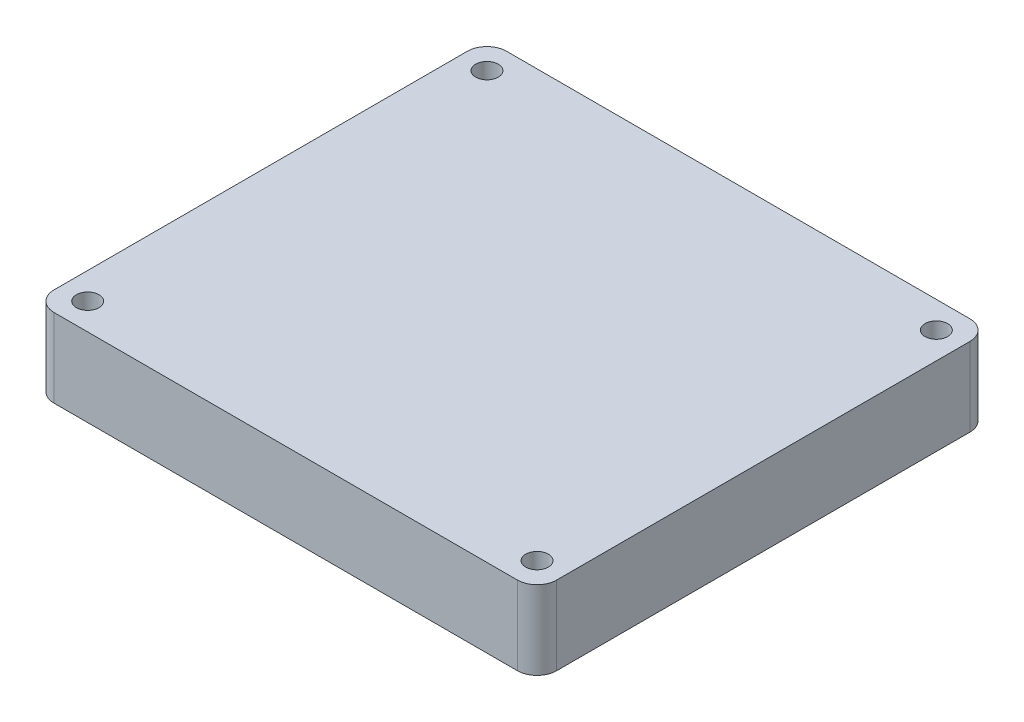
ISO-10303-21;
HEADER;
FILE_DESCRIPTION(('STEP AP214'),'2;1');
FILE_NAME('part.step','',(''),(''),'','','');
FILE_SCHEMA(('AUTOMOTIVE_DESIGN { 1 0 10303 214 1 1 1 1 }'));
ENDSEC;
DATA;
#1=APPLICATION_CONTEXT('core data for automotive mechanical design processes');
#2=APPLICATION_PROTOCOL_DEFINITION('international standard','automotive_design',2000,#1);
#3=PRODUCT_CONTEXT('',#1,'mechanical');
#4=PRODUCT('Part','Part','',(#3));
#5=PRODUCT_RELATED_PRODUCT_CATEGORY('part','',(#4));
#6=PRODUCT_DEFINITION_FORMATION('','',#4);
#7=PRODUCT_DEFINITION_CONTEXT('part definition',#1,'design');
#8=PRODUCT_DEFINITION('design','',#6,#7);
#9=PRODUCT_DEFINITION_SHAPE('','',#8);
#10=(LENGTH_UNIT() NAMED_UNIT(*) SI_UNIT(.MILLI.,.METRE.));
#11=(NAMED_UNIT(*) PLANE_ANGLE_UNIT() SI_UNIT($,.RADIAN.));
#12=(NAMED_UNIT(*) SI_UNIT($,.STERADIAN.) SOLID_ANGLE_UNIT());
#13=UNCERTAINTY_MEASURE_WITH_UNIT(LENGTH_MEASURE(1.E-05),#10,'distance_accuracy_value','');
#14=(GEOMETRIC_REPRESENTATION_CONTEXT(3) GLOBAL_UNCERTAINTY_ASSIGNED_CONTEXT((#13)) GLOBAL_UNIT_ASSIGNED_CONTEXT((#10,
#11,#12)) REPRESENTATION_CONTEXT('',''));
#15=CARTESIAN_POINT('',(0.,0.,0.));
#16=DIRECTION('',(0.,0.,1.));
#17=DIRECTION('',(1.,0.,0.));
#18=AXIS2_PLACEMENT_3D('',#15,#16,#17);
#19=CARTESIAN_POINT('',(-66.0264767181984,10.16,6.88511388237897));
#20=DIRECTION('',(1.,0.,0.));
#21=DIRECTION('',(0.,0.,-1.));
#22=AXIS2_PLACEMENT_3D('',#19,#20,#21);
#23=PLANE('',#22);
#24=DIRECTION('',(0.,0.,1.));
#25=VECTOR('',#24,1.);
#26=CARTESIAN_POINT('',(-66.0264767181984,0.,6.88511388237897));
#27=LINE('',#26,#25);
#28=CARTESIAN_POINT('',(-66.0264767181984,0.,-49.096486117621));
#29=VERTEX_POINT('',#28);
#30=CARTESIAN_POINT('',(-66.0264767181984,0.,4.34511388237897));
#31=VERTEX_POINT('',#30);
#32=EDGE_CURVE('E128',#29,#31,#27,.T.);
#33=ORIENTED_EDGE('',*,*,#32,.T.);
#34=DIRECTION('',(0.,-1.,0.));
#35=VECTOR('',#34,1.);
#36=CARTESIAN_POINT('',(-66.0264767181984,10.16,4.34511388237897));
#37=LINE('',#36,#35);
#38=CARTESIAN_POINT('',(-66.0264767181984,10.16,4.34511388237897));
#39=VERTEX_POINT('',#38);
#40=EDGE_CURVE('E11',#31,#39,#37,.F.);
#41=ORIENTED_EDGE('',*,*,#40,.T.);
#42=DIRECTION('',(0.,0.,1.));
#43=VECTOR('',#42,1.);
#44=CARTESIAN_POINT('',(-66.0264767181984,10.16,6.88511388237897));
#45=LINE('',#44,#43);
#46=CARTESIAN_POINT('',(-66.0264767181984,10.16,-49.096486117621));
#47=VERTEX_POINT('',#46);
#48=EDGE_CURVE('E126',#47,#39,#45,.T.);
#49=ORIENTED_EDGE('',*,*,#48,.F.);
#50=DIRECTION('',(0.,-1.,0.));
#51=VECTOR('',#50,1.);
#52=CARTESIAN_POINT('',(-66.0264767181984,10.16,-49.096486117621));
#53=LINE('',#52,#51);
#54=EDGE_CURVE('E40',#47,#29,#53,.T.);
#55=ORIENTED_EDGE('',*,*,#54,.T.);
#56=EDGE_LOOP('',(#33,#41,#49,#55));
#57=FACE_BOUND('',#56,.T.);
#58=ADVANCED_FACE('F32',(#57),#23,.F.);
#59=CARTESIAN_POINT('',(-66.0264767181984,10.16,6.88511388237897));
#60=DIRECTION('',(0.,0.,-1.));
#61=DIRECTION('',(-1.,0.,0.));
#62=AXIS2_PLACEMENT_3D('',#59,#60,#61);
#63=PLANE('',#62);
#64=DIRECTION('',(1.,0.,0.));
#65=VECTOR('',#64,1.);
#66=CARTESIAN_POINT('',(-66.0264767181984,0.,6.88511388237897));
#67=LINE('',#66,#65);
#68=CARTESIAN_POINT('',(-63.4864767181984,0.,6.88511388237897));
#69=VERTEX_POINT('',#68);
#70=CARTESIAN_POINT('',(-3.56787671819842,0.,6.88511388237897));
#71=VERTEX_POINT('',#70);
#72=EDGE_CURVE('E124',#69,#71,#67,.T.);
#73=ORIENTED_EDGE('',*,*,#72,.T.);
#74=DIRECTION('',(0.,-1.,0.));
#75=VECTOR('',#74,1.);
#76=CARTESIAN_POINT('',(-3.56787671819842,10.16,6.88511388237897));
#77=LINE('',#76,#75);
#78=CARTESIAN_POINT('',(-3.56787671819842,10.16,6.88511388237897));
#79=VERTEX_POINT('',#78);
#80=EDGE_CURVE('E103',#71,#79,#77,.F.);
#81=ORIENTED_EDGE('',*,*,#80,.T.);
#82=DIRECTION('',(1.,0.,0.));
#83=VECTOR('',#82,1.);
#84=CARTESIAN_POINT('',(-66.0264767181984,10.16,6.88511388237897));
#85=LINE('',#84,#83);
#86=CARTESIAN_POINT('',(-63.4864767181984,10.16,6.88511388237897));
#87=VERTEX_POINT('',#86);
#88=EDGE_CURVE('E168',#87,#79,#85,.T.);
#89=ORIENTED_EDGE('',*,*,#88,.F.);
#90=DIRECTION('',(0.,-1.,0.));
#91=VECTOR('',#90,1.);
#92=CARTESIAN_POINT('',(-63.4864767181984,10.16,6.88511388237897));
#93=LINE('',#92,#91);
#94=EDGE_CURVE('E108',#87,#69,#93,.T.);
#95=ORIENTED_EDGE('',*,*,#94,.T.);
#96=EDGE_LOOP('',(#73,#81,#89,#95));
#97=FACE_BOUND('',#96,.T.);
#98=ADVANCED_FACE('F216',(#97),#63,.F.);
#99=CARTESIAN_POINT('',(-1.02787671819841,10.16,6.88511388237897));
#100=DIRECTION('',(-1.,0.,0.));
#101=DIRECTION('',(0.,0.,1.));
#102=AXIS2_PLACEMENT_3D('',#99,#100,#101);
#103=PLANE('',#102);
#104=DIRECTION('',(0.,0.,-1.));
#105=VECTOR('',#104,1.);
#106=CARTESIAN_POINT('',(-1.02787671819841,10.16,6.88511388237897));
#107=LINE('',#106,#105);
#108=CARTESIAN_POINT('',(-1.02787671819841,10.16,4.34511388237897));
#109=VERTEX_POINT('',#108);
#110=CARTESIAN_POINT('',(-1.02787671819841,10.16,-49.096486117621));
#111=VERTEX_POINT('',#110);
#112=EDGE_CURVE('E117',#109,#111,#107,.T.);
#113=ORIENTED_EDGE('',*,*,#112,.F.);
#114=DIRECTION('',(0.,-1.,0.));
#115=VECTOR('',#114,1.);
#116=CARTESIAN_POINT('',(-1.02787671819841,10.16,4.34511388237897));
#117=LINE('',#116,#115);
#118=CARTESIAN_POINT('',(-1.02787671819841,0.,4.34511388237897));
#119=VERTEX_POINT('',#118);
#120=EDGE_CURVE('E102',#109,#119,#117,.T.);
#121=ORIENTED_EDGE('',*,*,#120,.T.);
#122=DIRECTION('',(0.,0.,-1.));
#123=VECTOR('',#122,1.);
#124=CARTESIAN_POINT('',(-1.02787671819841,0.,6.88511388237897));
#125=LINE('',#124,#123);
#126=CARTESIAN_POINT('',(-1.02787671819841,0.,-49.096486117621));
#127=VERTEX_POINT('',#126);
#128=EDGE_CURVE('E115',#119,#127,#125,.T.);
#129=ORIENTED_EDGE('',*,*,#128,.T.);
#130=DIRECTION('',(0.,-1.,0.));
#131=VECTOR('',#130,1.);
#132=CARTESIAN_POINT('',(-1.02787671819841,10.16,-49.096486117621));
#133=LINE('',#132,#131);
#134=EDGE_CURVE('E119',#127,#111,#133,.F.);
#135=ORIENTED_EDGE('',*,*,#134,.T.);
#136=EDGE_LOOP('',(#113,#121,#129,#135));
#137=FACE_BOUND('',#136,.T.);
#138=ADVANCED_FACE('F114',(#137),#103,.F.);
#139=CARTESIAN_POINT('',(-66.0264767181984,10.16,-51.636486117621));
#140=DIRECTION('',(0.,0.,1.));
#141=DIRECTION('',(1.,0.,0.));
#142=AXIS2_PLACEMENT_3D('',#139,#140,#141);
#143=PLANE('',#142);
#144=DIRECTION('',(-1.,0.,0.));
#145=VECTOR('',#144,1.);
#146=CARTESIAN_POINT('',(-66.0264767181984,10.16,-51.636486117621));
#147=LINE('',#146,#145);
#148=CARTESIAN_POINT('',(-3.56787671819842,10.16,-51.636486117621));
#149=VERTEX_POINT('',#148);
#150=CARTESIAN_POINT('',(-63.4864767181984,10.16,-51.636486117621));
#151=VERTEX_POINT('',#150);
#152=EDGE_CURVE('E132',#149,#151,#147,.T.);
#153=ORIENTED_EDGE('',*,*,#152,.F.);
#154=DIRECTION('',(0.,-1.,0.));
#155=VECTOR('',#154,1.);
#156=CARTESIAN_POINT('',(-3.56787671819842,10.16,-51.636486117621));
#157=LINE('',#156,#155);
#158=CARTESIAN_POINT('',(-3.56787671819842,0.,-51.636486117621));
#159=VERTEX_POINT('',#158);
#160=EDGE_CURVE('E149',#149,#159,#157,.T.);
#161=ORIENTED_EDGE('',*,*,#160,.T.);
#162=DIRECTION('',(-1.,0.,0.));
#163=VECTOR('',#162,1.);
#164=CARTESIAN_POINT('',(-66.0264767181984,0.,-51.636486117621));
#165=LINE('',#164,#163);
#166=CARTESIAN_POINT('',(-63.4864767181984,0.,-51.636486117621));
#167=VERTEX_POINT('',#166);
#168=EDGE_CURVE('E123',#159,#167,#165,.T.);
#169=ORIENTED_EDGE('',*,*,#168,.T.);
#170=DIRECTION('',(0.,-1.,0.));
#171=VECTOR('',#170,1.);
#172=CARTESIAN_POINT('',(-63.4864767181984,10.16,-51.636486117621));
#173=LINE('',#172,#171);
#174=EDGE_CURVE('E47',#167,#151,#173,.F.);
#175=ORIENTED_EDGE('',*,*,#174,.T.);
#176=EDGE_LOOP('',(#153,#161,#169,#175));
#177=FACE_BOUND('',#176,.T.);
#178=ADVANCED_FACE('F205',(#177),#143,.F.);
#179=CARTESIAN_POINT('',(0.,10.16,0.));
#180=DIRECTION('',(0.,-1.,0.));
#181=DIRECTION('',(0.,0.,-1.));
#182=AXIS2_PLACEMENT_3D('',#179,#180,#181);
#183=PLANE('',#182);
#184=CARTESIAN_POINT('',(-62.5847767181984,10.16,3.44341388237897));
#185=DIRECTION('',(0.,1.,0.));
#186=DIRECTION('',(0.,0.,-1.));
#187=AXIS2_PLACEMENT_3D('',#184,#185,#186);
#188=CIRCLE('',#187,1.4605);
#189=CARTESIAN_POINT('',(-62.5847767181984,10.16,1.98291388237897));
#190=VERTEX_POINT('',#189);
#191=EDGE_CURVE('E187',#190,#190,#188,.T.);
#192=ORIENTED_EDGE('',*,*,#191,.F.);
#193=EDGE_LOOP('',(#192));
#194=FACE_BOUND('',#193,.T.);
#195=CARTESIAN_POINT('',(-62.5847767181984,10.16,-48.194786117621));
#196=DIRECTION('',(0.,1.,0.));
#197=DIRECTION('',(0.,0.,1.));
#198=AXIS2_PLACEMENT_3D('',#195,#196,#197);
#199=CIRCLE('',#198,1.4605);
#200=CARTESIAN_POINT('',(-62.5847767181984,10.16,-46.734286117621));
#201=VERTEX_POINT('',#200);
#202=EDGE_CURVE('E181',#201,#201,#199,.T.);
#203=ORIENTED_EDGE('',*,*,#202,.F.);
#204=EDGE_LOOP('',(#203));
#205=FACE_BOUND('',#204,.T.);
#206=CARTESIAN_POINT('',(-4.46957671819842,10.16,-48.194786117621));
#207=DIRECTION('',(0.,1.,0.));
#208=DIRECTION('',(0.,0.,-1.));
#209=AXIS2_PLACEMENT_3D('',#206,#207,#208);
#210=CIRCLE('',#209,1.4605);
#211=CARTESIAN_POINT('',(-4.46957671819842,10.16,-49.655286117621));
#212=VERTEX_POINT('',#211);
#213=EDGE_CURVE('E175',#212,#212,#210,.T.);
#214=ORIENTED_EDGE('',*,*,#213,.F.);
#215=EDGE_LOOP('',(#214));
#216=FACE_BOUND('',#215,.T.);
#217=CARTESIAN_POINT('',(-4.46957671819842,10.16,3.44341388237897));
#218=DIRECTION('',(0.,1.,0.));
#219=DIRECTION('',(0.,0.,1.));
#220=AXIS2_PLACEMENT_3D('',#217,#218,#219);
#221=CIRCLE('',#220,1.4605);
#222=CARTESIAN_POINT('',(-4.46957671819842,10.16,4.90391388237897));
#223=VERTEX_POINT('',#222);
#224=EDGE_CURVE('E163',#223,#223,#221,.T.);
#225=ORIENTED_EDGE('',*,*,#224,.F.);
#226=EDGE_LOOP('',(#225));
#227=FACE_BOUND('',#226,.T.);
#228=ORIENTED_EDGE('',*,*,#88,.T.);
#229=CARTESIAN_POINT('',(-3.56787671819841,10.16,4.34511388237897));
#230=DIRECTION('',(0.,-1.,0.));
#231=DIRECTION('',(0.,0.,-1.));
#232=AXIS2_PLACEMENT_3D('',#229,#230,#231);
#233=CIRCLE('',#232,2.54);
#234=EDGE_CURVE('E146',#79,#109,#233,.F.);
#235=ORIENTED_EDGE('',*,*,#234,.T.);
#236=ORIENTED_EDGE('',*,*,#112,.T.);
#237=CARTESIAN_POINT('',(-3.56787671819842,10.16,-49.096486117621));
#238=DIRECTION('',(0.,-1.,0.));
#239=DIRECTION('',(0.,0.,-1.));
#240=AXIS2_PLACEMENT_3D('',#237,#238,#239);
#241=CIRCLE('',#240,2.54);
#242=EDGE_CURVE('E54',#111,#149,#241,.F.);
#243=ORIENTED_EDGE('',*,*,#242,.T.);
#244=ORIENTED_EDGE('',*,*,#152,.T.);
#245=CARTESIAN_POINT('',(-63.4864767181984,10.16,-49.096486117621));
#246=DIRECTION('',(0.,-1.,0.));
#247=DIRECTION('',(0.,0.,-1.));
#248=AXIS2_PLACEMENT_3D('',#245,#246,#247);
#249=CIRCLE('',#248,2.54);
#250=EDGE_CURVE('E141',#151,#47,#249,.F.);
#251=ORIENTED_EDGE('',*,*,#250,.T.);
#252=ORIENTED_EDGE('',*,*,#48,.T.);
#253=CARTESIAN_POINT('',(-63.4864767181984,10.16,4.34511388237897));
#254=DIRECTION('',(0.,-1.,0.));
#255=DIRECTION('',(0.,0.,-1.));
#256=AXIS2_PLACEMENT_3D('',#253,#254,#255);
#257=CIRCLE('',#256,2.54);
#258=EDGE_CURVE('E143',#39,#87,#257,.F.);
#259=ORIENTED_EDGE('',*,*,#258,.T.);
#260=EDGE_LOOP('',(#228,#235,#236,#243,#244,#251,#252,#259));
#261=FACE_BOUND('',#260,.T.);
#262=ADVANCED_FACE('F202',(#194,#205,#216,#227,#261),#183,.F.);
#263=CARTESIAN_POINT('',(0.,0.,0.));
#264=DIRECTION('',(0.,-1.,0.));
#265=DIRECTION('',(0.,0.,-1.));
#266=AXIS2_PLACEMENT_3D('',#263,#264,#265);
#267=PLANE('',#266);
#268=CARTESIAN_POINT('',(-62.5847767181984,0.,3.44341388237897));
#269=DIRECTION('',(0.,1.,0.));
#270=DIRECTION('',(0.,0.,-1.));
#271=AXIS2_PLACEMENT_3D('',#268,#269,#270);
#272=CIRCLE('',#271,1.4605);
#273=CARTESIAN_POINT('',(-62.5847767181984,0.,1.98291388237897));
#274=VERTEX_POINT('',#273);
#275=EDGE_CURVE('E184',#274,#274,#272,.T.);
#276=ORIENTED_EDGE('',*,*,#275,.T.);
#277=EDGE_LOOP('',(#276));
#278=FACE_BOUND('',#277,.T.);
#279=CARTESIAN_POINT('',(-62.5847767181984,0.,-48.194786117621));
#280=DIRECTION('',(0.,1.,0.));
#281=DIRECTION('',(0.,0.,1.));
#282=AXIS2_PLACEMENT_3D('',#279,#280,#281);
#283=CIRCLE('',#282,1.4605);
#284=CARTESIAN_POINT('',(-62.5847767181984,0.,-46.734286117621));
#285=VERTEX_POINT('',#284);
#286=EDGE_CURVE('E178',#285,#285,#283,.T.);
#287=ORIENTED_EDGE('',*,*,#286,.T.);
#288=EDGE_LOOP('',(#287));
#289=FACE_BOUND('',#288,.T.);
#290=CARTESIAN_POINT('',(-4.46957671819842,0.,-48.194786117621));
#291=DIRECTION('',(0.,1.,0.));
#292=DIRECTION('',(0.,0.,-1.));
#293=AXIS2_PLACEMENT_3D('',#290,#291,#292);
#294=CIRCLE('',#293,1.4605);
#295=CARTESIAN_POINT('',(-4.46957671819842,0.,-49.655286117621));
#296=VERTEX_POINT('',#295);
#297=EDGE_CURVE('E173',#296,#296,#294,.T.);
#298=ORIENTED_EDGE('',*,*,#297,.T.);
#299=EDGE_LOOP('',(#298));
#300=FACE_BOUND('',#299,.T.);
#301=CARTESIAN_POINT('',(-4.46957671819842,0.,3.44341388237897));
#302=DIRECTION('',(0.,1.,0.));
#303=DIRECTION('',(0.,0.,1.));
#304=AXIS2_PLACEMENT_3D('',#301,#302,#303);
#305=CIRCLE('',#304,1.4605);
#306=CARTESIAN_POINT('',(-4.46957671819842,0.,4.90391388237897));
#307=VERTEX_POINT('',#306);
#308=EDGE_CURVE('E161',#307,#307,#305,.T.);
#309=ORIENTED_EDGE('',*,*,#308,.T.);
#310=EDGE_LOOP('',(#309));
#311=FACE_BOUND('',#310,.T.);
#312=ORIENTED_EDGE('',*,*,#128,.F.);
#313=CARTESIAN_POINT('',(-3.56787671819841,0.,4.34511388237897));
#314=DIRECTION('',(0.,-1.,0.));
#315=DIRECTION('',(0.,0.,-1.));
#316=AXIS2_PLACEMENT_3D('',#313,#314,#315);
#317=CIRCLE('',#316,2.54);
#318=EDGE_CURVE('E98',#119,#71,#317,.T.);
#319=ORIENTED_EDGE('',*,*,#318,.T.);
#320=ORIENTED_EDGE('',*,*,#72,.F.);
#321=CARTESIAN_POINT('',(-63.4864767181984,0.,4.34511388237897));
#322=DIRECTION('',(0.,-1.,0.));
#323=DIRECTION('',(0.,0.,-1.));
#324=AXIS2_PLACEMENT_3D('',#321,#322,#323);
#325=CIRCLE('',#324,2.54);
#326=EDGE_CURVE('E135',#69,#31,#325,.T.);
#327=ORIENTED_EDGE('',*,*,#326,.T.);
#328=ORIENTED_EDGE('',*,*,#32,.F.);
#329=CARTESIAN_POINT('',(-63.4864767181984,0.,-49.096486117621));
#330=DIRECTION('',(0.,-1.,0.));
#331=DIRECTION('',(0.,0.,-1.));
#332=AXIS2_PLACEMENT_3D('',#329,#330,#331);
#333=CIRCLE('',#332,2.54);
#334=EDGE_CURVE('E118',#29,#167,#333,.T.);
#335=ORIENTED_EDGE('',*,*,#334,.T.);
#336=ORIENTED_EDGE('',*,*,#168,.F.);
#337=CARTESIAN_POINT('',(-3.56787671819842,0.,-49.096486117621));
#338=DIRECTION('',(0.,-1.,0.));
#339=DIRECTION('',(0.,0.,-1.));
#340=AXIS2_PLACEMENT_3D('',#337,#338,#339);
#341=CIRCLE('',#340,2.54);
#342=EDGE_CURVE('E109',#159,#127,#341,.T.);
#343=ORIENTED_EDGE('',*,*,#342,.T.);
#344=EDGE_LOOP('',(#312,#319,#320,#327,#328,#335,#336,#343));
#345=FACE_BOUND('',#344,.T.);
#346=ADVANCED_FACE('F121',(#278,#289,#300,#311,#345),#267,.T.);
#347=CARTESIAN_POINT('',(-4.46957671819842,0.,3.44341388237897));
#348=DIRECTION('',(0.,1.,0.));
#349=DIRECTION('',(0.,0.,1.));
#350=AXIS2_PLACEMENT_3D('',#347,#348,#349);
#351=CYLINDRICAL_SURFACE('',#350,1.4605);
#352=ORIENTED_EDGE('',*,*,#308,.F.);
#353=EDGE_LOOP('',(#352));
#354=FACE_BOUND('',#353,.T.);
#355=ORIENTED_EDGE('',*,*,#224,.T.);
#356=EDGE_LOOP('',(#355));
#357=FACE_BOUND('',#356,.T.);
#358=ADVANCED_FACE('F246',(#354,#357),#351,.F.);
#359=CARTESIAN_POINT('',(-4.46957671819842,0.,-48.194786117621));
#360=DIRECTION('',(0.,1.,0.));
#361=DIRECTION('',(0.,0.,1.));
#362=AXIS2_PLACEMENT_3D('',#359,#360,#361);
#363=CYLINDRICAL_SURFACE('',#362,1.4605);
#364=ORIENTED_EDGE('',*,*,#297,.F.);
#365=EDGE_LOOP('',(#364));
#366=FACE_BOUND('',#365,.T.);
#367=ORIENTED_EDGE('',*,*,#213,.T.);
#368=EDGE_LOOP('',(#367));
#369=FACE_BOUND('',#368,.T.);
#370=ADVANCED_FACE('F250',(#366,#369),#363,.F.);
#371=CARTESIAN_POINT('',(-62.5847767181984,0.,-48.194786117621));
#372=DIRECTION('',(0.,1.,0.));
#373=DIRECTION('',(0.,0.,1.));
#374=AXIS2_PLACEMENT_3D('',#371,#372,#373);
#375=CYLINDRICAL_SURFACE('',#374,1.4605);
#376=ORIENTED_EDGE('',*,*,#286,.F.);
#377=EDGE_LOOP('',(#376));
#378=FACE_BOUND('',#377,.T.);
#379=ORIENTED_EDGE('',*,*,#202,.T.);
#380=EDGE_LOOP('',(#379));
#381=FACE_BOUND('',#380,.T.);
#382=ADVANCED_FACE('F198',(#378,#381),#375,.F.);
#383=CARTESIAN_POINT('',(-62.5847767181984,0.,3.44341388237897));
#384=DIRECTION('',(0.,1.,0.));
#385=DIRECTION('',(0.,0.,1.));
#386=AXIS2_PLACEMENT_3D('',#383,#384,#385);
#387=CYLINDRICAL_SURFACE('',#386,1.4605);
#388=ORIENTED_EDGE('',*,*,#275,.F.);
#389=EDGE_LOOP('',(#388));
#390=FACE_BOUND('',#389,.T.);
#391=ORIENTED_EDGE('',*,*,#191,.T.);
#392=EDGE_LOOP('',(#391));
#393=FACE_BOUND('',#392,.T.);
#394=ADVANCED_FACE('F195',(#390,#393),#387,.F.);
#395=CARTESIAN_POINT('',(-3.56787671819841,10.16,4.34511388237897));
#396=DIRECTION('',(0.,-1.,0.));
#397=DIRECTION('',(0.,0.,-1.));
#398=AXIS2_PLACEMENT_3D('',#395,#396,#397);
#399=CYLINDRICAL_SURFACE('',#398,2.54);
#400=ORIENTED_EDGE('',*,*,#234,.F.);
#401=ORIENTED_EDGE('',*,*,#80,.F.);
#402=ORIENTED_EDGE('',*,*,#318,.F.);
#403=ORIENTED_EDGE('',*,*,#120,.F.);
#404=EDGE_LOOP('',(#400,#401,#402,#403));
#405=FACE_BOUND('',#404,.T.);
#406=ADVANCED_FACE('F101',(#405),#399,.T.);
#407=CARTESIAN_POINT('',(-3.56787671819842,10.16,-49.096486117621));
#408=DIRECTION('',(0.,-1.,0.));
#409=DIRECTION('',(0.,0.,-1.));
#410=AXIS2_PLACEMENT_3D('',#407,#408,#409);
#411=CYLINDRICAL_SURFACE('',#410,2.54);
#412=ORIENTED_EDGE('',*,*,#242,.F.);
#413=ORIENTED_EDGE('',*,*,#134,.F.);
#414=ORIENTED_EDGE('',*,*,#342,.F.);
#415=ORIENTED_EDGE('',*,*,#160,.F.);
#416=EDGE_LOOP('',(#412,#413,#414,#415));
#417=FACE_BOUND('',#416,.T.);
#418=ADVANCED_FACE('F223',(#417),#411,.T.);
#419=CARTESIAN_POINT('',(-63.4864767181984,10.16,4.34511388237897));
#420=DIRECTION('',(0.,-1.,0.));
#421=DIRECTION('',(0.,0.,-1.));
#422=AXIS2_PLACEMENT_3D('',#419,#420,#421);
#423=CYLINDRICAL_SURFACE('',#422,2.54);
#424=ORIENTED_EDGE('',*,*,#258,.F.);
#425=ORIENTED_EDGE('',*,*,#40,.F.);
#426=ORIENTED_EDGE('',*,*,#326,.F.);
#427=ORIENTED_EDGE('',*,*,#94,.F.);
#428=EDGE_LOOP('',(#424,#425,#426,#427));
#429=FACE_BOUND('',#428,.T.);
#430=ADVANCED_FACE('F218',(#429),#423,.T.);
#431=CARTESIAN_POINT('',(-63.4864767181984,10.16,-49.096486117621));
#432=DIRECTION('',(0.,-1.,0.));
#433=DIRECTION('',(0.,0.,-1.));
#434=AXIS2_PLACEMENT_3D('',#431,#432,#433);
#435=CYLINDRICAL_SURFACE('',#434,2.54);
#436=ORIENTED_EDGE('',*,*,#250,.F.);
#437=ORIENTED_EDGE('',*,*,#174,.F.);
#438=ORIENTED_EDGE('',*,*,#334,.F.);
#439=ORIENTED_EDGE('',*,*,#54,.F.);
#440=EDGE_LOOP('',(#436,#437,#438,#439));
#441=FACE_BOUND('',#440,.T.);
#442=ADVANCED_FACE('F34',(#441),#435,.T.);
#443=CLOSED_SHELL('',(#58,#98,#138,#178,#262,#346,#358,#370,#382,#394,#406,#418,#430,#442));
#444=MANIFOLD_SOLID_BREP('B2',#443);
#445=ADVANCED_BREP_SHAPE_REPRESENTATION('',(#18,#444),#14);
#446=SHAPE_DEFINITION_REPRESENTATION(#9,#445);
ENDSEC;
END-ISO-10303-21;
